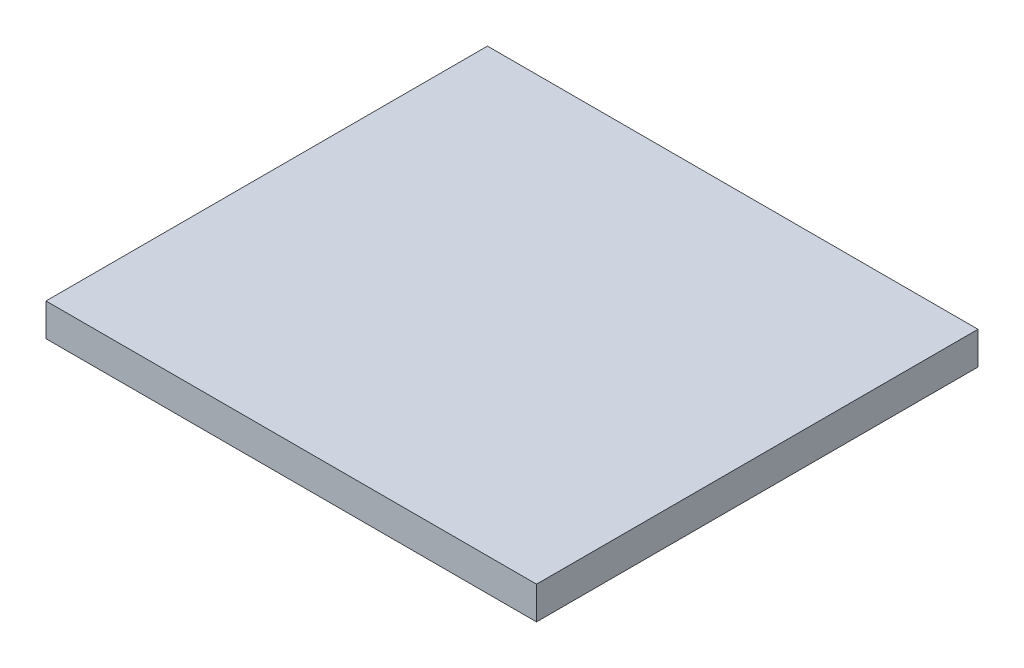
ISO-10303-21;
HEADER;
FILE_DESCRIPTION(('STEP AP214'),'2;1');
FILE_NAME('part.step','',(''),(''),'','','');
FILE_SCHEMA(('AUTOMOTIVE_DESIGN { 1 0 10303 214 1 1 1 1 }'));
ENDSEC;
DATA;
#1=APPLICATION_CONTEXT('core data for automotive mechanical design processes');
#2=APPLICATION_PROTOCOL_DEFINITION('international standard','automotive_design',2000,#1);
#3=PRODUCT_CONTEXT('',#1,'mechanical');
#4=PRODUCT('Part','Part','',(#3));
#5=PRODUCT_RELATED_PRODUCT_CATEGORY('part','',(#4));
#6=PRODUCT_DEFINITION_FORMATION('','',#4);
#7=PRODUCT_DEFINITION_CONTEXT('part definition',#1,'design');
#8=PRODUCT_DEFINITION('design','',#6,#7);
#9=PRODUCT_DEFINITION_SHAPE('','',#8);
#10=(LENGTH_UNIT() NAMED_UNIT(*) SI_UNIT(.MILLI.,.METRE.));
#11=(NAMED_UNIT(*) PLANE_ANGLE_UNIT() SI_UNIT($,.RADIAN.));
#12=(NAMED_UNIT(*) SI_UNIT($,.STERADIAN.) SOLID_ANGLE_UNIT());
#13=UNCERTAINTY_MEASURE_WITH_UNIT(LENGTH_MEASURE(1.E-05),#10,'distance_accuracy_value','');
#14=(GEOMETRIC_REPRESENTATION_CONTEXT(3) GLOBAL_UNCERTAINTY_ASSIGNED_CONTEXT((#13)) GLOBAL_UNIT_ASSIGNED_CONTEXT((#10,
#11,#12)) REPRESENTATION_CONTEXT('',''));
#15=CARTESIAN_POINT('',(0.,0.,0.));
#16=DIRECTION('',(0.,0.,1.));
#17=DIRECTION('',(1.,0.,0.));
#18=AXIS2_PLACEMENT_3D('',#15,#16,#17);
#19=CARTESIAN_POINT('',(75.,5.,135.));
#20=DIRECTION('',(-1.,0.,0.));
#21=DIRECTION('',(0.,0.,1.));
#22=AXIS2_PLACEMENT_3D('',#19,#20,#21);
#23=PLANE('',#22);
#24=DIRECTION('',(0.,1.,0.));
#25=VECTOR('',#24,1.);
#26=CARTESIAN_POINT('',(75.,5.,0.));
#27=LINE('',#26,#25);
#28=CARTESIAN_POINT('',(75.,-5.,0.));
#29=VERTEX_POINT('',#28);
#30=CARTESIAN_POINT('',(75.,5.,0.));
#31=VERTEX_POINT('',#30);
#32=EDGE_CURVE('E100',#29,#31,#27,.T.);
#33=ORIENTED_EDGE('',*,*,#32,.T.);
#34=DIRECTION('',(0.,0.,-1.));
#35=VECTOR('',#34,1.);
#36=CARTESIAN_POINT('',(75.,5.,135.));
#37=LINE('',#36,#35);
#38=CARTESIAN_POINT('',(75.,5.,135.));
#39=VERTEX_POINT('',#38);
#40=EDGE_CURVE('E11',#39,#31,#37,.T.);
#41=ORIENTED_EDGE('',*,*,#40,.F.);
#42=DIRECTION('',(0.,1.,0.));
#43=VECTOR('',#42,1.);
#44=CARTESIAN_POINT('',(75.,5.,135.));
#45=LINE('',#44,#43);
#46=CARTESIAN_POINT('',(75.,-5.,135.));
#47=VERTEX_POINT('',#46);
#48=EDGE_CURVE('E88',#47,#39,#45,.T.);
#49=ORIENTED_EDGE('',*,*,#48,.F.);
#50=DIRECTION('',(0.,0.,-1.));
#51=VECTOR('',#50,1.);
#52=CARTESIAN_POINT('',(75.,-5.,135.));
#53=LINE('',#52,#51);
#54=EDGE_CURVE('E96',#47,#29,#53,.T.);
#55=ORIENTED_EDGE('',*,*,#54,.T.);
#56=EDGE_LOOP('',(#33,#41,#49,#55));
#57=FACE_BOUND('',#56,.T.);
#58=ADVANCED_FACE('F37',(#57),#23,.F.);
#59=CARTESIAN_POINT('',(-75.,5.,135.));
#60=DIRECTION('',(0.,-1.,0.));
#61=DIRECTION('',(0.,0.,-1.));
#62=AXIS2_PLACEMENT_3D('',#59,#60,#61);
#63=PLANE('',#62);
#64=DIRECTION('',(-1.,0.,0.));
#65=VECTOR('',#64,1.);
#66=CARTESIAN_POINT('',(-75.,5.,0.));
#67=LINE('',#66,#65);
#68=CARTESIAN_POINT('',(-75.,5.,0.));
#69=VERTEX_POINT('',#68);
#70=EDGE_CURVE('E92',#31,#69,#67,.T.);
#71=ORIENTED_EDGE('',*,*,#70,.T.);
#72=DIRECTION('',(0.,0.,-1.));
#73=VECTOR('',#72,1.);
#74=CARTESIAN_POINT('',(-75.,5.,135.));
#75=LINE('',#74,#73);
#76=CARTESIAN_POINT('',(-75.,5.,135.));
#77=VERTEX_POINT('',#76);
#78=EDGE_CURVE('E45',#77,#69,#75,.T.);
#79=ORIENTED_EDGE('',*,*,#78,.F.);
#80=DIRECTION('',(-1.,0.,0.));
#81=VECTOR('',#80,1.);
#82=CARTESIAN_POINT('',(-75.,5.,135.));
#83=LINE('',#82,#81);
#84=EDGE_CURVE('E83',#39,#77,#83,.T.);
#85=ORIENTED_EDGE('',*,*,#84,.F.);
#86=ORIENTED_EDGE('',*,*,#40,.T.);
#87=EDGE_LOOP('',(#71,#79,#85,#86));
#88=FACE_BOUND('',#87,.T.);
#89=ADVANCED_FACE('F91',(#88),#63,.F.);
#90=CARTESIAN_POINT('',(-75.,5.,135.));
#91=DIRECTION('',(1.,0.,0.));
#92=DIRECTION('',(0.,0.,-1.));
#93=AXIS2_PLACEMENT_3D('',#90,#91,#92);
#94=PLANE('',#93);
#95=DIRECTION('',(0.,-1.,0.));
#96=VECTOR('',#95,1.);
#97=CARTESIAN_POINT('',(-75.,5.,0.));
#98=LINE('',#97,#96);
#99=CARTESIAN_POINT('',(-75.,-5.,0.));
#100=VERTEX_POINT('',#99);
#101=EDGE_CURVE('E70',#69,#100,#98,.T.);
#102=ORIENTED_EDGE('',*,*,#101,.T.);
#103=DIRECTION('',(0.,0.,-1.));
#104=VECTOR('',#103,1.);
#105=CARTESIAN_POINT('',(-75.,-5.,135.));
#106=LINE('',#105,#104);
#107=CARTESIAN_POINT('',(-75.,-5.,135.));
#108=VERTEX_POINT('',#107);
#109=EDGE_CURVE('E93',#108,#100,#106,.T.);
#110=ORIENTED_EDGE('',*,*,#109,.F.);
#111=DIRECTION('',(0.,-1.,0.));
#112=VECTOR('',#111,1.);
#113=CARTESIAN_POINT('',(-75.,5.,135.));
#114=LINE('',#113,#112);
#115=EDGE_CURVE('E86',#77,#108,#114,.T.);
#116=ORIENTED_EDGE('',*,*,#115,.F.);
#117=ORIENTED_EDGE('',*,*,#78,.T.);
#118=EDGE_LOOP('',(#102,#110,#116,#117));
#119=FACE_BOUND('',#118,.T.);
#120=ADVANCED_FACE('F94',(#119),#94,.F.);
#121=CARTESIAN_POINT('',(-75.,-5.,135.));
#122=DIRECTION('',(0.,1.,0.));
#123=DIRECTION('',(0.,0.,1.));
#124=AXIS2_PLACEMENT_3D('',#121,#122,#123);
#125=PLANE('',#124);
#126=DIRECTION('',(1.,0.,0.));
#127=VECTOR('',#126,1.);
#128=CARTESIAN_POINT('',(-75.,-5.,0.));
#129=LINE('',#128,#127);
#130=EDGE_CURVE('E76',#100,#29,#129,.T.);
#131=ORIENTED_EDGE('',*,*,#130,.T.);
#132=ORIENTED_EDGE('',*,*,#54,.F.);
#133=DIRECTION('',(1.,0.,0.));
#134=VECTOR('',#133,1.);
#135=CARTESIAN_POINT('',(-75.,-5.,135.));
#136=LINE('',#135,#134);
#137=EDGE_CURVE('E53',#108,#47,#136,.T.);
#138=ORIENTED_EDGE('',*,*,#137,.F.);
#139=ORIENTED_EDGE('',*,*,#109,.T.);
#140=EDGE_LOOP('',(#131,#132,#138,#139));
#141=FACE_BOUND('',#140,.T.);
#142=ADVANCED_FACE('F107',(#141),#125,.F.);
#143=CARTESIAN_POINT('',(0.,0.,135.));
#144=DIRECTION('',(0.,0.,1.));
#145=DIRECTION('',(1.,0.,0.));
#146=AXIS2_PLACEMENT_3D('',#143,#144,#145);
#147=PLANE('',#146);
#148=ORIENTED_EDGE('',*,*,#48,.T.);
#149=ORIENTED_EDGE('',*,*,#84,.T.);
#150=ORIENTED_EDGE('',*,*,#115,.T.);
#151=ORIENTED_EDGE('',*,*,#137,.T.);
#152=EDGE_LOOP('',(#148,#149,#150,#151));
#153=FACE_BOUND('',#152,.T.);
#154=ADVANCED_FACE('F84',(#153),#147,.T.);
#155=CARTESIAN_POINT('',(0.,0.,0.));
#156=DIRECTION('',(0.,0.,1.));
#157=DIRECTION('',(1.,0.,0.));
#158=AXIS2_PLACEMENT_3D('',#155,#156,#157);
#159=PLANE('',#158);
#160=ORIENTED_EDGE('',*,*,#32,.F.);
#161=ORIENTED_EDGE('',*,*,#130,.F.);
#162=ORIENTED_EDGE('',*,*,#101,.F.);
#163=ORIENTED_EDGE('',*,*,#70,.F.);
#164=EDGE_LOOP('',(#160,#161,#162,#163));
#165=FACE_BOUND('',#164,.T.);
#166=ADVANCED_FACE('F110',(#165),#159,.F.);
#167=CLOSED_SHELL('',(#58,#89,#120,#142,#154,#166));
#168=MANIFOLD_SOLID_BREP('B2',#167);
#169=ADVANCED_BREP_SHAPE_REPRESENTATION('',(#18,#168),#14);
#170=SHAPE_DEFINITION_REPRESENTATION(#9,#169);
ENDSEC;
END-ISO-10303-21;
